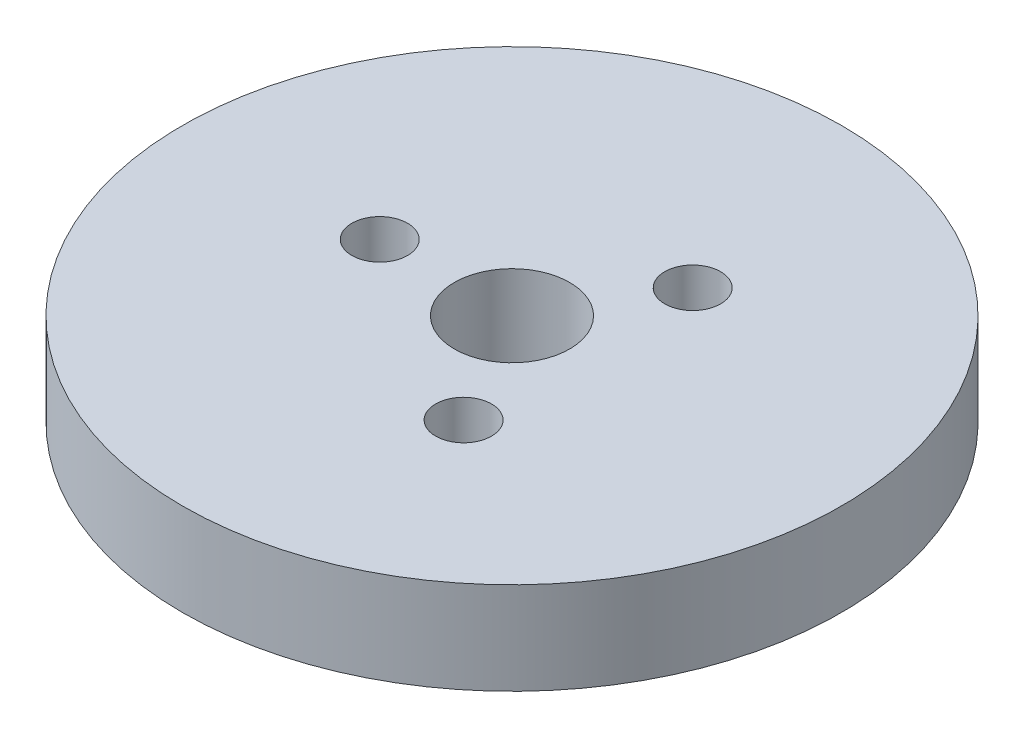
ISO-10303-21;
HEADER;
FILE_DESCRIPTION(('STEP AP214'),'2;1');
FILE_NAME('part.step','',(''),(''),'','','');
FILE_SCHEMA(('AUTOMOTIVE_DESIGN { 1 0 10303 214 1 1 1 1 }'));
ENDSEC;
DATA;
#1=APPLICATION_CONTEXT('core data for automotive mechanical design processes');
#2=APPLICATION_PROTOCOL_DEFINITION('international standard','automotive_design',2000,#1);
#3=PRODUCT_CONTEXT('',#1,'mechanical');
#4=PRODUCT('Part','Part','',(#3));
#5=PRODUCT_RELATED_PRODUCT_CATEGORY('part','',(#4));
#6=PRODUCT_DEFINITION_FORMATION('','',#4);
#7=PRODUCT_DEFINITION_CONTEXT('part definition',#1,'design');
#8=PRODUCT_DEFINITION('design','',#6,#7);
#9=PRODUCT_DEFINITION_SHAPE('','',#8);
#10=(LENGTH_UNIT() NAMED_UNIT(*) SI_UNIT(.MILLI.,.METRE.));
#11=(NAMED_UNIT(*) PLANE_ANGLE_UNIT() SI_UNIT($,.RADIAN.));
#12=(NAMED_UNIT(*) SI_UNIT($,.STERADIAN.) SOLID_ANGLE_UNIT());
#13=UNCERTAINTY_MEASURE_WITH_UNIT(LENGTH_MEASURE(1.E-05),#10,'distance_accuracy_value','');
#14=(GEOMETRIC_REPRESENTATION_CONTEXT(3) GLOBAL_UNCERTAINTY_ASSIGNED_CONTEXT((#13)) GLOBAL_UNIT_ASSIGNED_CONTEXT((#10,
#11,#12)) REPRESENTATION_CONTEXT('',''));
#15=CARTESIAN_POINT('',(0.,0.,0.));
#16=DIRECTION('',(0.,0.,1.));
#17=DIRECTION('',(1.,0.,0.));
#18=AXIS2_PLACEMENT_3D('',#15,#16,#17);
#19=CARTESIAN_POINT('',(0.,28.,0.));
#20=DIRECTION('',(0.,-1.,0.));
#21=DIRECTION('',(0.,0.,-1.));
#22=AXIS2_PLACEMENT_3D('',#19,#20,#21);
#23=CYLINDRICAL_SURFACE('',#22,100.);
#24=CARTESIAN_POINT('',(0.,28.,0.));
#25=DIRECTION('',(0.,1.,0.));
#26=DIRECTION('',(0.,0.,1.));
#27=AXIS2_PLACEMENT_3D('',#24,#25,#26);
#28=CIRCLE('',#27,100.);
#29=CARTESIAN_POINT('',(0.,28.,100.));
#30=VERTEX_POINT('',#29);
#31=EDGE_CURVE('E10',#30,#30,#28,.T.);
#32=ORIENTED_EDGE('',*,*,#31,.F.);
#33=EDGE_LOOP('',(#32));
#34=FACE_BOUND('',#33,.T.);
#35=CARTESIAN_POINT('',(0.,0.,0.));
#36=DIRECTION('',(0.,1.,0.));
#37=DIRECTION('',(0.,0.,1.));
#38=AXIS2_PLACEMENT_3D('',#35,#36,#37);
#39=CIRCLE('',#38,100.);
#40=CARTESIAN_POINT('',(0.,0.,100.));
#41=VERTEX_POINT('',#40);
#42=EDGE_CURVE('E37',#41,#41,#39,.T.);
#43=ORIENTED_EDGE('',*,*,#42,.T.);
#44=EDGE_LOOP('',(#43));
#45=FACE_BOUND('',#44,.T.);
#46=ADVANCED_FACE('F40',(#34,#45),#23,.T.);
#47=CARTESIAN_POINT('',(0.,28.,0.));
#48=DIRECTION('',(0.,1.,0.));
#49=DIRECTION('',(0.,0.,1.));
#50=AXIS2_PLACEMENT_3D('',#47,#48,#49);
#51=PLANE('',#50);
#52=CARTESIAN_POINT('',(20.0673730903712,28.,34.757709766963));
#53=DIRECTION('',(0.,1.,0.));
#54=DIRECTION('',(0.866025403784436,0.,-0.500000000000004));
#55=AXIS2_PLACEMENT_3D('',#52,#53,#54);
#56=CIRCLE('',#55,8.47466319725649);
#57=CARTESIAN_POINT('',(20.0673730903712,28.,43.2323729642195));
#58=VERTEX_POINT('',#57);
#59=EDGE_CURVE('E70',#58,#58,#56,.T.);
#60=ORIENTED_EDGE('',*,*,#59,.F.);
#61=EDGE_LOOP('',(#60));
#62=FACE_BOUND('',#61,.T.);
#63=CARTESIAN_POINT('',(20.0673730903707,28.,-34.7577097669633));
#64=DIRECTION('',(0.,1.,0.));
#65=DIRECTION('',(-0.866025403784443,0.,-0.499999999999992));
#66=AXIS2_PLACEMENT_3D('',#63,#64,#65);
#67=CIRCLE('',#66,8.47466319725649);
#68=CARTESIAN_POINT('',(20.0673730903707,28.,-26.2830465697068));
#69=VERTEX_POINT('',#68);
#70=EDGE_CURVE('E61',#69,#69,#67,.T.);
#71=ORIENTED_EDGE('',*,*,#70,.F.);
#72=EDGE_LOOP('',(#71));
#73=FACE_BOUND('',#72,.T.);
#74=CARTESIAN_POINT('',(-40.1347461807421,28.,0.));
#75=DIRECTION('',(0.,1.,0.));
#76=DIRECTION('',(0.,0.,1.));
#77=AXIS2_PLACEMENT_3D('',#74,#75,#76);
#78=CIRCLE('',#77,8.47466319725649);
#79=CARTESIAN_POINT('',(-40.1347461807421,28.,8.47466319725649));
#80=VERTEX_POINT('',#79);
#81=EDGE_CURVE('E54',#80,#80,#78,.T.);
#82=ORIENTED_EDGE('',*,*,#81,.F.);
#83=EDGE_LOOP('',(#82));
#84=FACE_BOUND('',#83,.T.);
#85=CARTESIAN_POINT('',(0.,28.,0.));
#86=DIRECTION('',(0.,1.,0.));
#87=DIRECTION('',(0.,0.,1.));
#88=AXIS2_PLACEMENT_3D('',#85,#86,#87);
#89=CIRCLE('',#88,17.5);
#90=CARTESIAN_POINT('',(0.,28.,17.5));
#91=VERTEX_POINT('',#90);
#92=EDGE_CURVE('E50',#91,#91,#89,.T.);
#93=ORIENTED_EDGE('',*,*,#92,.F.);
#94=EDGE_LOOP('',(#93));
#95=FACE_BOUND('',#94,.T.);
#96=ORIENTED_EDGE('',*,*,#31,.T.);
#97=EDGE_LOOP('',(#96));
#98=FACE_BOUND('',#97,.T.);
#99=ADVANCED_FACE('F85',(#62,#73,#84,#95,#98),#51,.T.);
#100=CARTESIAN_POINT('',(0.,0.,0.));
#101=DIRECTION('',(0.,1.,0.));
#102=DIRECTION('',(0.,0.,1.));
#103=AXIS2_PLACEMENT_3D('',#100,#101,#102);
#104=PLANE('',#103);
#105=CARTESIAN_POINT('',(0.,0.,0.));
#106=DIRECTION('',(0.,1.,0.));
#107=DIRECTION('',(0.,0.,1.));
#108=AXIS2_PLACEMENT_3D('',#105,#106,#107);
#109=CIRCLE('',#108,17.5);
#110=CARTESIAN_POINT('',(0.,0.,17.5));
#111=VERTEX_POINT('',#110);
#112=EDGE_CURVE('E47',#111,#111,#109,.T.);
#113=ORIENTED_EDGE('',*,*,#112,.T.);
#114=EDGE_LOOP('',(#113));
#115=FACE_BOUND('',#114,.T.);
#116=ORIENTED_EDGE('',*,*,#42,.F.);
#117=EDGE_LOOP('',(#116));
#118=FACE_BOUND('',#117,.T.);
#119=ADVANCED_FACE('F84',(#115,#118),#104,.F.);
#120=CARTESIAN_POINT('',(0.,28.,0.));
#121=DIRECTION('',(0.,-1.,0.));
#122=DIRECTION('',(0.,0.,-1.));
#123=AXIS2_PLACEMENT_3D('',#120,#121,#122);
#124=CYLINDRICAL_SURFACE('',#123,17.5);
#125=ORIENTED_EDGE('',*,*,#92,.T.);
#126=EDGE_LOOP('',(#125));
#127=FACE_BOUND('',#126,.T.);
#128=ORIENTED_EDGE('',*,*,#112,.F.);
#129=EDGE_LOOP('',(#128));
#130=FACE_BOUND('',#129,.T.);
#131=ADVANCED_FACE('F91',(#127,#130),#124,.F.);
#132=CARTESIAN_POINT('',(-40.1347461807421,0.274629676879211,0.));
#133=DIRECTION('',(0.,1.,0.));
#134=DIRECTION('',(0.,0.,1.));
#135=AXIS2_PLACEMENT_3D('',#132,#133,#134);
#136=CYLINDRICAL_SURFACE('',#135,8.47466319725649);
#137=CARTESIAN_POINT('',(-40.1347461807421,0.274629676879211,0.));
#138=DIRECTION('',(0.,1.,0.));
#139=DIRECTION('',(0.,0.,1.));
#140=AXIS2_PLACEMENT_3D('',#137,#138,#139);
#141=CIRCLE('',#140,8.47466319725649);
#142=CARTESIAN_POINT('',(-40.1347461807421,0.274629676879211,8.47466319725649));
#143=VERTEX_POINT('',#142);
#144=EDGE_CURVE('E55',#143,#143,#141,.T.);
#145=CARTESIAN_POINT('',(-40.1347461807421,0.274629676879211,8.47466319725649));
#146=CARTESIAN_POINT('',(-40.1347461807421,0.563435617745053,8.47466319725649));
#147=CARTESIAN_POINT('',(-40.1347461807421,0.852241558610894,8.47466319725649));
#148=CARTESIAN_POINT('',(-40.1347461807421,1.42985344034258,8.47466319725649));
#149=CARTESIAN_POINT('',(-40.1347461807421,1.71865938120842,8.47466319725649));
#150=CARTESIAN_POINT('',(-40.1347461807421,2.2962712629401,8.47466319725649));
#151=CARTESIAN_POINT('',(-40.1347461807421,2.58507720380594,8.47466319725649));
#152=CARTESIAN_POINT('',(-40.1347461807421,3.16268908553763,8.47466319725649));
#153=CARTESIAN_POINT('',(-40.1347461807421,3.45149502640347,8.47466319725649));
#154=CARTESIAN_POINT('',(-40.1347461807421,4.02910690813515,8.47466319725649));
#155=CARTESIAN_POINT('',(-40.1347461807421,4.31791284900099,8.47466319725649));
#156=CARTESIAN_POINT('',(-40.1347461807421,4.89552473073268,8.47466319725649));
#157=CARTESIAN_POINT('',(-40.1347461807421,5.18433067159852,8.47466319725649));
#158=CARTESIAN_POINT('',(-40.1347461807421,5.7619425533302,8.47466319725649));
#159=CARTESIAN_POINT('',(-40.1347461807421,6.05074849419604,8.47466319725649));
#160=CARTESIAN_POINT('',(-40.1347461807421,6.62836037592773,8.47466319725649));
#161=CARTESIAN_POINT('',(-40.1347461807421,6.91716631679357,8.47466319725649));
#162=CARTESIAN_POINT('',(-40.1347461807421,7.49477819852525,8.47466319725649));
#163=CARTESIAN_POINT('',(-40.1347461807421,7.78358413939109,8.47466319725649));
#164=CARTESIAN_POINT('',(-40.1347461807421,8.36119602112277,8.47466319725649));
#165=CARTESIAN_POINT('',(-40.1347461807421,8.65000196198861,8.47466319725649));
#166=CARTESIAN_POINT('',(-40.1347461807421,9.2276138437203,8.47466319725649));
#167=CARTESIAN_POINT('',(-40.1347461807421,9.51641978458614,8.47466319725649));
#168=CARTESIAN_POINT('',(-40.1347461807421,10.0940316663178,8.47466319725649));
#169=CARTESIAN_POINT('',(-40.1347461807421,10.3828376071837,8.47466319725649));
#170=CARTESIAN_POINT('',(-40.1347461807421,10.9604494889153,8.47466319725649));
#171=CARTESIAN_POINT('',(-40.1347461807421,11.2492554297812,8.47466319725649));
#172=CARTESIAN_POINT('',(-40.1347461807421,11.8268673115129,8.47466319725649));
#173=CARTESIAN_POINT('',(-40.1347461807421,12.1156732523787,8.47466319725649));
#174=CARTESIAN_POINT('',(-40.1347461807421,12.6932851341104,8.47466319725649));
#175=CARTESIAN_POINT('',(-40.1347461807421,12.9820910749762,8.47466319725649));
#176=CARTESIAN_POINT('',(-40.1347461807421,13.5597029567079,8.47466319725649));
#177=CARTESIAN_POINT('',(-40.1347461807421,13.8485088975738,8.47466319725649));
#178=CARTESIAN_POINT('',(-40.1347461807421,14.4261207793054,8.47466319725649));
#179=CARTESIAN_POINT('',(-40.1347461807421,14.7149267201713,8.47466319725649));
#180=CARTESIAN_POINT('',(-40.1347461807421,15.292538601903,8.47466319725649));
#181=CARTESIAN_POINT('',(-40.1347461807421,15.5813445427688,8.47466319725649));
#182=CARTESIAN_POINT('',(-40.1347461807421,16.1589564245005,8.47466319725649));
#183=CARTESIAN_POINT('',(-40.1347461807421,16.4477623653663,8.47466319725649));
#184=CARTESIAN_POINT('',(-40.1347461807421,17.025374247098,8.47466319725649));
#185=CARTESIAN_POINT('',(-40.1347461807421,17.3141801879639,8.47466319725649));
#186=CARTESIAN_POINT('',(-40.1347461807421,17.8917920696955,8.47466319725649));
#187=CARTESIAN_POINT('',(-40.1347461807421,18.1805980105614,8.47466319725649));
#188=CARTESIAN_POINT('',(-40.1347461807421,18.7582098922931,8.47466319725649));
#189=CARTESIAN_POINT('',(-40.1347461807421,19.0470158331589,8.47466319725649));
#190=CARTESIAN_POINT('',(-40.1347461807421,19.6246277148906,8.47466319725649));
#191=CARTESIAN_POINT('',(-40.1347461807421,19.9134336557564,8.47466319725649));
#192=CARTESIAN_POINT('',(-40.1347461807421,20.4910455374881,8.47466319725649));
#193=CARTESIAN_POINT('',(-40.1347461807421,20.779851478354,8.47466319725649));
#194=CARTESIAN_POINT('',(-40.1347461807421,21.3574633600856,8.47466319725649));
#195=CARTESIAN_POINT('',(-40.1347461807421,21.6462693009515,8.47466319725649));
#196=CARTESIAN_POINT('',(-40.1347461807421,22.2238811826832,8.47466319725649));
#197=CARTESIAN_POINT('',(-40.1347461807421,22.512687123549,8.47466319725649));
#198=CARTESIAN_POINT('',(-40.1347461807421,23.0902990052807,8.47466319725649));
#199=CARTESIAN_POINT('',(-40.1347461807421,23.3791049461465,8.47466319725649));
#200=CARTESIAN_POINT('',(-40.1347461807421,23.9567168278782,8.47466319725649));
#201=CARTESIAN_POINT('',(-40.1347461807421,24.2455227687441,8.47466319725649));
#202=CARTESIAN_POINT('',(-40.1347461807421,24.8231346504757,8.47466319725649));
#203=CARTESIAN_POINT('',(-40.1347461807421,25.1119405913416,8.47466319725649));
#204=CARTESIAN_POINT('',(-40.1347461807421,25.6895524730733,8.47466319725649));
#205=CARTESIAN_POINT('',(-40.1347461807421,25.9783584139391,8.47466319725649));
#206=CARTESIAN_POINT('',(-40.1347461807421,26.5559702956708,8.47466319725649));
#207=CARTESIAN_POINT('',(-40.1347461807421,26.8447762365366,8.47466319725649));
#208=CARTESIAN_POINT('',(-40.1347461807421,27.4223881182683,8.47466319725649));
#209=CARTESIAN_POINT('',(-40.1347461807421,27.7111940591342,8.47466319725649));
#210=CARTESIAN_POINT('',(-40.1347461807421,28.,8.47466319725649));
#211=B_SPLINE_CURVE_WITH_KNOTS('',3,(#145,#146,#147,#148,#149,#150,#151,#152,#153,#154,#155,
#156,#157,#158,#159,#160,#161,#162,#163,#164,#165,#166,#167,#168,#169,#170,#171,#172,#173,#174,
#175,#176,#177,#178,#179,#180,#181,#182,#183,#184,#185,#186,#187,#188,#189,#190,#191,#192,#193,
#194,#195,#196,#197,#198,#199,#200,#201,#202,#203,#204,#205,#206,#207,#208,#209,#210),
.UNSPECIFIED.,.F.,.F.,(4,2,2,2,2,2,2,2,2,2,2,2,2,2,2,2,2,2,2,2,2,2,2,2,2,2,2,2,2,2,2,2,4),(0.,
0.866417822597525,1.73283564519505,2.59925346779257,3.4656712903901,4.33208911298762,
5.19850693558515,6.06492475818267,6.9313425807802,7.79776040337772,8.66417822597525,
9.53059604857277,10.3970138711703,11.2634316937678,12.1298495163653,12.9962673389629,
13.8626851615604,14.7291029841579,15.5955208067554,16.461938629353,17.3283564519505,
18.194774274548,19.0611920971455,19.9276099197431,20.7940277423406,21.6604455649381,
22.5268633875356,23.3932812101332,24.2596990327307,25.1261168553282,25.9925346779257,
26.8589525005233,27.7253703231208),.UNSPECIFIED.);
#212=EDGE_CURVE('BSEAM96',#143,#80,#211,.T.);
#213=ORIENTED_EDGE('',*,*,#144,.F.);
#214=ORIENTED_EDGE('',*,*,#81,.T.);
#215=ORIENTED_EDGE('',*,*,#212,.T.);
#216=ORIENTED_EDGE('',*,*,#212,.F.);
#217=EDGE_LOOP('',(#213,#215,#214,#216));
#218=FACE_BOUND('',#217,.T.);
#219=ADVANCED_FACE('F96',(#218),#136,.F.);
#220=CARTESIAN_POINT('',(-40.1347461807421,0.274629676879211,0.));
#221=DIRECTION('',(0.,1.,0.));
#222=DIRECTION('',(0.,0.,1.));
#223=AXIS2_PLACEMENT_3D('',#220,#221,#222);
#224=PLANE('',#223);
#225=ORIENTED_EDGE('',*,*,#144,.T.);
#226=EDGE_LOOP('',(#225));
#227=FACE_BOUND('',#226,.T.);
#228=ADVANCED_FACE('F127',(#227),#224,.T.);
#229=CARTESIAN_POINT('',(20.0673730903707,0.274629676879211,-34.7577097669633));
#230=DIRECTION('',(0.,1.,0.));
#231=DIRECTION('',(0.,0.,1.));
#232=AXIS2_PLACEMENT_3D('',#229,#230,#231);
#233=CYLINDRICAL_SURFACE('',#232,8.47466319725649);
#234=CARTESIAN_POINT('',(20.0673730903707,0.274629676879211,-34.7577097669633));
#235=DIRECTION('',(0.,1.,0.));
#236=DIRECTION('',(-0.866025403784443,0.,-0.499999999999992));
#237=AXIS2_PLACEMENT_3D('',#234,#235,#236);
#238=CIRCLE('',#237,8.47466319725649);
#239=CARTESIAN_POINT('',(20.0673730903707,0.274629676879211,-26.2830465697068));
#240=VERTEX_POINT('',#239);
#241=EDGE_CURVE('E63',#240,#240,#238,.T.);
#242=CARTESIAN_POINT('',(20.0673730903707,0.274629676879211,-26.2830465697068));
#243=CARTESIAN_POINT('',(20.0673730903707,0.563435617745053,-26.2830465697068));
#244=CARTESIAN_POINT('',(20.0673730903707,0.852241558610894,-26.2830465697068));
#245=CARTESIAN_POINT('',(20.0673730903707,1.42985344034258,-26.2830465697068));
#246=CARTESIAN_POINT('',(20.0673730903707,1.71865938120842,-26.2830465697068));
#247=CARTESIAN_POINT('',(20.0673730903707,2.2962712629401,-26.2830465697068));
#248=CARTESIAN_POINT('',(20.0673730903707,2.58507720380594,-26.2830465697068));
#249=CARTESIAN_POINT('',(20.0673730903707,3.16268908553763,-26.2830465697068));
#250=CARTESIAN_POINT('',(20.0673730903707,3.45149502640347,-26.2830465697068));
#251=CARTESIAN_POINT('',(20.0673730903707,4.02910690813515,-26.2830465697068));
#252=CARTESIAN_POINT('',(20.0673730903707,4.31791284900099,-26.2830465697068));
#253=CARTESIAN_POINT('',(20.0673730903707,4.89552473073268,-26.2830465697068));
#254=CARTESIAN_POINT('',(20.0673730903707,5.18433067159852,-26.2830465697068));
#255=CARTESIAN_POINT('',(20.0673730903707,5.7619425533302,-26.2830465697068));
#256=CARTESIAN_POINT('',(20.0673730903707,6.05074849419604,-26.2830465697068));
#257=CARTESIAN_POINT('',(20.0673730903707,6.62836037592773,-26.2830465697068));
#258=CARTESIAN_POINT('',(20.0673730903707,6.91716631679357,-26.2830465697068));
#259=CARTESIAN_POINT('',(20.0673730903707,7.49477819852525,-26.2830465697068));
#260=CARTESIAN_POINT('',(20.0673730903707,7.78358413939109,-26.2830465697068));
#261=CARTESIAN_POINT('',(20.0673730903707,8.36119602112277,-26.2830465697068));
#262=CARTESIAN_POINT('',(20.0673730903707,8.65000196198861,-26.2830465697068));
#263=CARTESIAN_POINT('',(20.0673730903707,9.2276138437203,-26.2830465697068));
#264=CARTESIAN_POINT('',(20.0673730903707,9.51641978458614,-26.2830465697068));
#265=CARTESIAN_POINT('',(20.0673730903707,10.0940316663178,-26.2830465697068));
#266=CARTESIAN_POINT('',(20.0673730903707,10.3828376071837,-26.2830465697068));
#267=CARTESIAN_POINT('',(20.0673730903707,10.9604494889153,-26.2830465697068));
#268=CARTESIAN_POINT('',(20.0673730903707,11.2492554297812,-26.2830465697068));
#269=CARTESIAN_POINT('',(20.0673730903707,11.8268673115129,-26.2830465697068));
#270=CARTESIAN_POINT('',(20.0673730903707,12.1156732523787,-26.2830465697068));
#271=CARTESIAN_POINT('',(20.0673730903707,12.6932851341104,-26.2830465697068));
#272=CARTESIAN_POINT('',(20.0673730903707,12.9820910749762,-26.2830465697068));
#273=CARTESIAN_POINT('',(20.0673730903707,13.5597029567079,-26.2830465697068));
#274=CARTESIAN_POINT('',(20.0673730903707,13.8485088975738,-26.2830465697068));
#275=CARTESIAN_POINT('',(20.0673730903707,14.4261207793054,-26.2830465697068));
#276=CARTESIAN_POINT('',(20.0673730903707,14.7149267201713,-26.2830465697068));
#277=CARTESIAN_POINT('',(20.0673730903707,15.292538601903,-26.2830465697068));
#278=CARTESIAN_POINT('',(20.0673730903707,15.5813445427688,-26.2830465697068));
#279=CARTESIAN_POINT('',(20.0673730903707,16.1589564245005,-26.2830465697068));
#280=CARTESIAN_POINT('',(20.0673730903707,16.4477623653663,-26.2830465697068));
#281=CARTESIAN_POINT('',(20.0673730903707,17.025374247098,-26.2830465697068));
#282=CARTESIAN_POINT('',(20.0673730903707,17.3141801879639,-26.2830465697068));
#283=CARTESIAN_POINT('',(20.0673730903707,17.8917920696955,-26.2830465697068));
#284=CARTESIAN_POINT('',(20.0673730903707,18.1805980105614,-26.2830465697068));
#285=CARTESIAN_POINT('',(20.0673730903707,18.7582098922931,-26.2830465697068));
#286=CARTESIAN_POINT('',(20.0673730903707,19.0470158331589,-26.2830465697068));
#287=CARTESIAN_POINT('',(20.0673730903707,19.6246277148906,-26.2830465697068));
#288=CARTESIAN_POINT('',(20.0673730903707,19.9134336557564,-26.2830465697068));
#289=CARTESIAN_POINT('',(20.0673730903707,20.4910455374881,-26.2830465697068));
#290=CARTESIAN_POINT('',(20.0673730903707,20.779851478354,-26.2830465697068));
#291=CARTESIAN_POINT('',(20.0673730903707,21.3574633600856,-26.2830465697068));
#292=CARTESIAN_POINT('',(20.0673730903707,21.6462693009515,-26.2830465697068));
#293=CARTESIAN_POINT('',(20.0673730903707,22.2238811826832,-26.2830465697068));
#294=CARTESIAN_POINT('',(20.0673730903707,22.512687123549,-26.2830465697068));
#295=CARTESIAN_POINT('',(20.0673730903707,23.0902990052807,-26.2830465697068));
#296=CARTESIAN_POINT('',(20.0673730903707,23.3791049461465,-26.2830465697068));
#297=CARTESIAN_POINT('',(20.0673730903707,23.9567168278782,-26.2830465697068));
#298=CARTESIAN_POINT('',(20.0673730903707,24.2455227687441,-26.2830465697068));
#299=CARTESIAN_POINT('',(20.0673730903707,24.8231346504757,-26.2830465697068));
#300=CARTESIAN_POINT('',(20.0673730903707,25.1119405913416,-26.2830465697068));
#301=CARTESIAN_POINT('',(20.0673730903707,25.6895524730733,-26.2830465697068));
#302=CARTESIAN_POINT('',(20.0673730903707,25.9783584139391,-26.2830465697068));
#303=CARTESIAN_POINT('',(20.0673730903707,26.5559702956708,-26.2830465697068));
#304=CARTESIAN_POINT('',(20.0673730903707,26.8447762365366,-26.2830465697068));
#305=CARTESIAN_POINT('',(20.0673730903707,27.4223881182683,-26.2830465697068));
#306=CARTESIAN_POINT('',(20.0673730903707,27.7111940591342,-26.2830465697068));
#307=CARTESIAN_POINT('',(20.0673730903707,28.,-26.2830465697068));
#308=B_SPLINE_CURVE_WITH_KNOTS('',3,(#242,#243,#244,#245,#246,#247,#248,#249,#250,#251,#252,
#253,#254,#255,#256,#257,#258,#259,#260,#261,#262,#263,#264,#265,#266,#267,#268,#269,#270,#271,
#272,#273,#274,#275,#276,#277,#278,#279,#280,#281,#282,#283,#284,#285,#286,#287,#288,#289,#290,
#291,#292,#293,#294,#295,#296,#297,#298,#299,#300,#301,#302,#303,#304,#305,#306,#307),
.UNSPECIFIED.,.F.,.F.,(4,2,2,2,2,2,2,2,2,2,2,2,2,2,2,2,2,2,2,2,2,2,2,2,2,2,2,2,2,2,2,2,4),(0.,
0.866417822597525,1.73283564519505,2.59925346779257,3.4656712903901,4.33208911298762,
5.19850693558515,6.06492475818267,6.9313425807802,7.79776040337772,8.66417822597525,
9.53059604857277,10.3970138711703,11.2634316937678,12.1298495163653,12.9962673389629,
13.8626851615604,14.7291029841579,15.5955208067554,16.461938629353,17.3283564519505,
18.194774274548,19.0611920971455,19.9276099197431,20.7940277423406,21.6604455649381,
22.5268633875356,23.3932812101332,24.2596990327307,25.1261168553282,25.9925346779257,
26.8589525005233,27.7253703231208),.UNSPECIFIED.);
#309=EDGE_CURVE('BSEAM133',#240,#69,#308,.T.);
#310=ORIENTED_EDGE('',*,*,#241,.F.);
#311=ORIENTED_EDGE('',*,*,#70,.T.);
#312=ORIENTED_EDGE('',*,*,#309,.T.);
#313=ORIENTED_EDGE('',*,*,#309,.F.);
#314=EDGE_LOOP('',(#310,#312,#311,#313));
#315=FACE_BOUND('',#314,.T.);
#316=ADVANCED_FACE('F133',(#315),#233,.F.);
#317=CARTESIAN_POINT('',(20.0673730903707,0.274629676879211,-34.7577097669633));
#318=DIRECTION('',(0.,1.,0.));
#319=DIRECTION('',(-0.866025403784443,0.,-0.499999999999992));
#320=AXIS2_PLACEMENT_3D('',#317,#318,#319);
#321=PLANE('',#320);
#322=ORIENTED_EDGE('',*,*,#241,.T.);
#323=EDGE_LOOP('',(#322));
#324=FACE_BOUND('',#323,.T.);
#325=ADVANCED_FACE('F77',(#324),#321,.T.);
#326=CARTESIAN_POINT('',(20.0673730903712,0.274629676879211,34.757709766963));
#327=DIRECTION('',(0.,1.,0.));
#328=DIRECTION('',(0.,0.,1.));
#329=AXIS2_PLACEMENT_3D('',#326,#327,#328);
#330=CYLINDRICAL_SURFACE('',#329,8.47466319725649);
#331=CARTESIAN_POINT('',(20.0673730903712,0.274629676879211,34.757709766963));
#332=DIRECTION('',(0.,1.,0.));
#333=DIRECTION('',(0.866025403784436,0.,-0.500000000000004));
#334=AXIS2_PLACEMENT_3D('',#331,#332,#333);
#335=CIRCLE('',#334,8.47466319725649);
#336=CARTESIAN_POINT('',(20.0673730903712,0.274629676879211,43.2323729642195));
#337=VERTEX_POINT('',#336);
#338=EDGE_CURVE('E59',#337,#337,#335,.T.);
#339=CARTESIAN_POINT('',(20.0673730903712,0.274629676879211,43.2323729642195));
#340=CARTESIAN_POINT('',(20.0673730903712,0.563435617745053,43.2323729642195));
#341=CARTESIAN_POINT('',(20.0673730903712,0.852241558610894,43.2323729642195));
#342=CARTESIAN_POINT('',(20.0673730903712,1.42985344034258,43.2323729642195));
#343=CARTESIAN_POINT('',(20.0673730903712,1.71865938120842,43.2323729642195));
#344=CARTESIAN_POINT('',(20.0673730903712,2.2962712629401,43.2323729642195));
#345=CARTESIAN_POINT('',(20.0673730903712,2.58507720380594,43.2323729642195));
#346=CARTESIAN_POINT('',(20.0673730903712,3.16268908553763,43.2323729642195));
#347=CARTESIAN_POINT('',(20.0673730903712,3.45149502640347,43.2323729642195));
#348=CARTESIAN_POINT('',(20.0673730903712,4.02910690813515,43.2323729642195));
#349=CARTESIAN_POINT('',(20.0673730903712,4.31791284900099,43.2323729642195));
#350=CARTESIAN_POINT('',(20.0673730903712,4.89552473073268,43.2323729642195));
#351=CARTESIAN_POINT('',(20.0673730903712,5.18433067159852,43.2323729642195));
#352=CARTESIAN_POINT('',(20.0673730903712,5.7619425533302,43.2323729642195));
#353=CARTESIAN_POINT('',(20.0673730903712,6.05074849419604,43.2323729642195));
#354=CARTESIAN_POINT('',(20.0673730903712,6.62836037592773,43.2323729642195));
#355=CARTESIAN_POINT('',(20.0673730903712,6.91716631679357,43.2323729642195));
#356=CARTESIAN_POINT('',(20.0673730903712,7.49477819852525,43.2323729642195));
#357=CARTESIAN_POINT('',(20.0673730903712,7.78358413939109,43.2323729642195));
#358=CARTESIAN_POINT('',(20.0673730903712,8.36119602112277,43.2323729642195));
#359=CARTESIAN_POINT('',(20.0673730903712,8.65000196198861,43.2323729642195));
#360=CARTESIAN_POINT('',(20.0673730903712,9.2276138437203,43.2323729642195));
#361=CARTESIAN_POINT('',(20.0673730903712,9.51641978458614,43.2323729642195));
#362=CARTESIAN_POINT('',(20.0673730903712,10.0940316663178,43.2323729642195));
#363=CARTESIAN_POINT('',(20.0673730903712,10.3828376071837,43.2323729642195));
#364=CARTESIAN_POINT('',(20.0673730903712,10.9604494889153,43.2323729642195));
#365=CARTESIAN_POINT('',(20.0673730903712,11.2492554297812,43.2323729642195));
#366=CARTESIAN_POINT('',(20.0673730903712,11.8268673115129,43.2323729642195));
#367=CARTESIAN_POINT('',(20.0673730903712,12.1156732523787,43.2323729642195));
#368=CARTESIAN_POINT('',(20.0673730903712,12.6932851341104,43.2323729642195));
#369=CARTESIAN_POINT('',(20.0673730903712,12.9820910749762,43.2323729642195));
#370=CARTESIAN_POINT('',(20.0673730903712,13.5597029567079,43.2323729642195));
#371=CARTESIAN_POINT('',(20.0673730903712,13.8485088975738,43.2323729642195));
#372=CARTESIAN_POINT('',(20.0673730903712,14.4261207793054,43.2323729642195));
#373=CARTESIAN_POINT('',(20.0673730903712,14.7149267201713,43.2323729642195));
#374=CARTESIAN_POINT('',(20.0673730903712,15.292538601903,43.2323729642195));
#375=CARTESIAN_POINT('',(20.0673730903712,15.5813445427688,43.2323729642195));
#376=CARTESIAN_POINT('',(20.0673730903712,16.1589564245005,43.2323729642195));
#377=CARTESIAN_POINT('',(20.0673730903712,16.4477623653663,43.2323729642195));
#378=CARTESIAN_POINT('',(20.0673730903712,17.025374247098,43.2323729642195));
#379=CARTESIAN_POINT('',(20.0673730903712,17.3141801879639,43.2323729642195));
#380=CARTESIAN_POINT('',(20.0673730903712,17.8917920696955,43.2323729642195));
#381=CARTESIAN_POINT('',(20.0673730903712,18.1805980105614,43.2323729642195));
#382=CARTESIAN_POINT('',(20.0673730903712,18.7582098922931,43.2323729642195));
#383=CARTESIAN_POINT('',(20.0673730903712,19.0470158331589,43.2323729642195));
#384=CARTESIAN_POINT('',(20.0673730903712,19.6246277148906,43.2323729642195));
#385=CARTESIAN_POINT('',(20.0673730903712,19.9134336557564,43.2323729642195));
#386=CARTESIAN_POINT('',(20.0673730903712,20.4910455374881,43.2323729642195));
#387=CARTESIAN_POINT('',(20.0673730903712,20.779851478354,43.2323729642195));
#388=CARTESIAN_POINT('',(20.0673730903712,21.3574633600856,43.2323729642195));
#389=CARTESIAN_POINT('',(20.0673730903712,21.6462693009515,43.2323729642195));
#390=CARTESIAN_POINT('',(20.0673730903712,22.2238811826832,43.2323729642195));
#391=CARTESIAN_POINT('',(20.0673730903712,22.512687123549,43.2323729642195));
#392=CARTESIAN_POINT('',(20.0673730903712,23.0902990052807,43.2323729642195));
#393=CARTESIAN_POINT('',(20.0673730903712,23.3791049461465,43.2323729642195));
#394=CARTESIAN_POINT('',(20.0673730903712,23.9567168278782,43.2323729642195));
#395=CARTESIAN_POINT('',(20.0673730903712,24.2455227687441,43.2323729642195));
#396=CARTESIAN_POINT('',(20.0673730903712,24.8231346504757,43.2323729642195));
#397=CARTESIAN_POINT('',(20.0673730903712,25.1119405913416,43.2323729642195));
#398=CARTESIAN_POINT('',(20.0673730903712,25.6895524730733,43.2323729642195));
#399=CARTESIAN_POINT('',(20.0673730903712,25.9783584139391,43.2323729642195));
#400=CARTESIAN_POINT('',(20.0673730903712,26.5559702956708,43.2323729642195));
#401=CARTESIAN_POINT('',(20.0673730903712,26.8447762365366,43.2323729642195));
#402=CARTESIAN_POINT('',(20.0673730903712,27.4223881182683,43.2323729642195));
#403=CARTESIAN_POINT('',(20.0673730903712,27.7111940591342,43.2323729642195));
#404=CARTESIAN_POINT('',(20.0673730903712,28.,43.2323729642195));
#405=B_SPLINE_CURVE_WITH_KNOTS('',3,(#339,#340,#341,#342,#343,#344,#345,#346,#347,#348,#349,
#350,#351,#352,#353,#354,#355,#356,#357,#358,#359,#360,#361,#362,#363,#364,#365,#366,#367,#368,
#369,#370,#371,#372,#373,#374,#375,#376,#377,#378,#379,#380,#381,#382,#383,#384,#385,#386,#387,
#388,#389,#390,#391,#392,#393,#394,#395,#396,#397,#398,#399,#400,#401,#402,#403,#404),
.UNSPECIFIED.,.F.,.F.,(4,2,2,2,2,2,2,2,2,2,2,2,2,2,2,2,2,2,2,2,2,2,2,2,2,2,2,2,2,2,2,2,4),(0.,
0.866417822597525,1.73283564519505,2.59925346779257,3.4656712903901,4.33208911298762,
5.19850693558515,6.06492475818267,6.9313425807802,7.79776040337772,8.66417822597525,
9.53059604857277,10.3970138711703,11.2634316937678,12.1298495163653,12.9962673389629,
13.8626851615604,14.7291029841579,15.5955208067554,16.461938629353,17.3283564519505,
18.194774274548,19.0611920971455,19.9276099197431,20.7940277423406,21.6604455649381,
22.5268633875356,23.3932812101332,24.2596990327307,25.1261168553282,25.9925346779257,
26.8589525005233,27.7253703231208),.UNSPECIFIED.);
#406=EDGE_CURVE('BSEAM73',#337,#58,#405,.T.);
#407=ORIENTED_EDGE('',*,*,#338,.F.);
#408=ORIENTED_EDGE('',*,*,#59,.T.);
#409=ORIENTED_EDGE('',*,*,#406,.T.);
#410=ORIENTED_EDGE('',*,*,#406,.F.);
#411=EDGE_LOOP('',(#407,#409,#408,#410));
#412=FACE_BOUND('',#411,.T.);
#413=ADVANCED_FACE('F73',(#412),#330,.F.);
#414=CARTESIAN_POINT('',(20.0673730903712,0.274629676879211,34.757709766963));
#415=DIRECTION('',(0.,1.,0.));
#416=DIRECTION('',(0.866025403784436,0.,-0.500000000000004));
#417=AXIS2_PLACEMENT_3D('',#414,#415,#416);
#418=PLANE('',#417);
#419=ORIENTED_EDGE('',*,*,#338,.T.);
#420=EDGE_LOOP('',(#419));
#421=FACE_BOUND('',#420,.T.);
#422=ADVANCED_FACE('F71',(#421),#418,.T.);
#423=CLOSED_SHELL('',(#46,#99,#119,#131,#219,#228,#316,#325,#413,#422));
#424=MANIFOLD_SOLID_BREP('B2',#423);
#425=ADVANCED_BREP_SHAPE_REPRESENTATION('',(#18,#424),#14);
#426=SHAPE_DEFINITION_REPRESENTATION(#9,#425);
ENDSEC;
END-ISO-10303-21;
